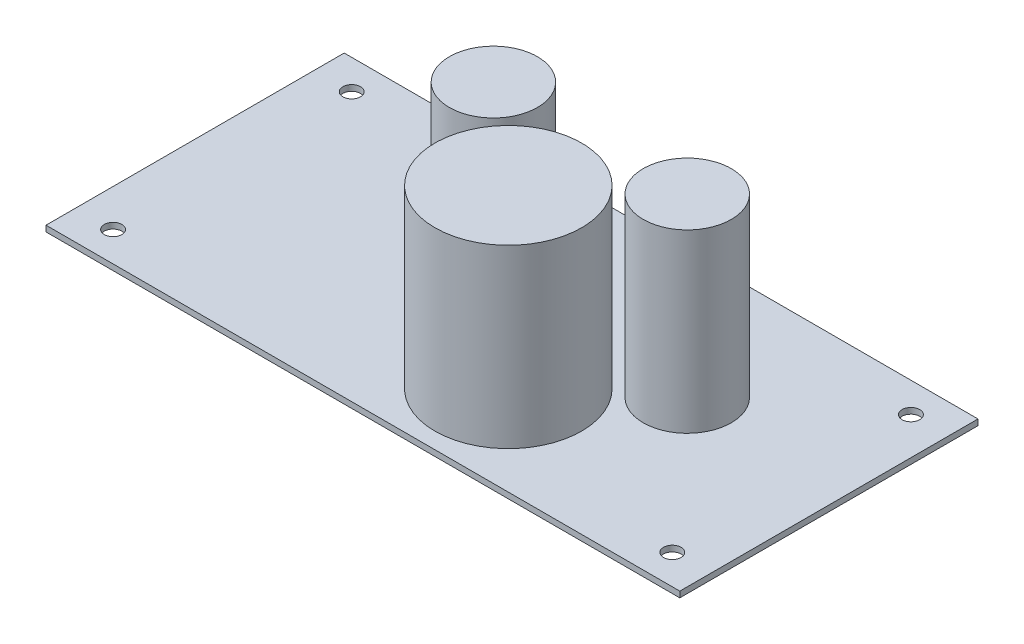
ISO-10303-21;
HEADER;
FILE_DESCRIPTION(('STEP AP214'),'2;1');
FILE_NAME('part.step','',(''),(''),'','','');
FILE_SCHEMA(('AUTOMOTIVE_DESIGN { 1 0 10303 214 1 1 1 1 }'));
ENDSEC;
DATA;
#1=APPLICATION_CONTEXT('core data for automotive mechanical design processes');
#2=APPLICATION_PROTOCOL_DEFINITION('international standard','automotive_design',2000,#1);
#3=PRODUCT_CONTEXT('',#1,'mechanical');
#4=PRODUCT('Part','Part','',(#3));
#5=PRODUCT_RELATED_PRODUCT_CATEGORY('part','',(#4));
#6=PRODUCT_DEFINITION_FORMATION('','',#4);
#7=PRODUCT_DEFINITION_CONTEXT('part definition',#1,'design');
#8=PRODUCT_DEFINITION('design','',#6,#7);
#9=PRODUCT_DEFINITION_SHAPE('','',#8);
#10=(LENGTH_UNIT() NAMED_UNIT(*) SI_UNIT(.MILLI.,.METRE.));
#11=(NAMED_UNIT(*) PLANE_ANGLE_UNIT() SI_UNIT($,.RADIAN.));
#12=(NAMED_UNIT(*) SI_UNIT($,.STERADIAN.) SOLID_ANGLE_UNIT());
#13=UNCERTAINTY_MEASURE_WITH_UNIT(LENGTH_MEASURE(1.E-05),#10,'distance_accuracy_value','');
#14=(GEOMETRIC_REPRESENTATION_CONTEXT(3) GLOBAL_UNCERTAINTY_ASSIGNED_CONTEXT((#13)) GLOBAL_UNIT_ASSIGNED_CONTEXT((#10,
#11,#12)) REPRESENTATION_CONTEXT('',''));
#15=CARTESIAN_POINT('',(0.,0.,0.));
#16=DIRECTION('',(0.,0.,1.));
#17=DIRECTION('',(1.,0.,0.));
#18=AXIS2_PLACEMENT_3D('',#15,#16,#17);
#19=CARTESIAN_POINT('',(-53.975,1.,-25.395));
#20=DIRECTION('',(1.,0.,0.));
#21=DIRECTION('',(0.,0.,-1.));
#22=AXIS2_PLACEMENT_3D('',#19,#20,#21);
#23=PLANE('',#22);
#24=DIRECTION('',(0.,0.,1.));
#25=VECTOR('',#24,1.);
#26=CARTESIAN_POINT('',(-53.975,0.,-25.395));
#27=LINE('',#26,#25);
#28=CARTESIAN_POINT('',(-53.975,0.,-25.395));
#29=VERTEX_POINT('',#28);
#30=CARTESIAN_POINT('',(-53.975,0.,25.395));
#31=VERTEX_POINT('',#30);
#32=EDGE_CURVE('E98',#29,#31,#27,.T.);
#33=ORIENTED_EDGE('',*,*,#32,.T.);
#34=DIRECTION('',(0.,-1.,0.));
#35=VECTOR('',#34,1.);
#36=CARTESIAN_POINT('',(-53.975,1.,25.395));
#37=LINE('',#36,#35);
#38=CARTESIAN_POINT('',(-53.975,1.,25.395));
#39=VERTEX_POINT('',#38);
#40=EDGE_CURVE('E11',#39,#31,#37,.T.);
#41=ORIENTED_EDGE('',*,*,#40,.F.);
#42=DIRECTION('',(0.,0.,1.));
#43=VECTOR('',#42,1.);
#44=CARTESIAN_POINT('',(-53.975,1.,-25.395));
#45=LINE('',#44,#43);
#46=CARTESIAN_POINT('',(-53.975,1.,-25.395));
#47=VERTEX_POINT('',#46);
#48=EDGE_CURVE('E86',#47,#39,#45,.T.);
#49=ORIENTED_EDGE('',*,*,#48,.F.);
#50=DIRECTION('',(0.,-1.,0.));
#51=VECTOR('',#50,1.);
#52=CARTESIAN_POINT('',(-53.975,1.,-25.395));
#53=LINE('',#52,#51);
#54=EDGE_CURVE('E94',#47,#29,#53,.T.);
#55=ORIENTED_EDGE('',*,*,#54,.T.);
#56=EDGE_LOOP('',(#33,#41,#49,#55));
#57=FACE_BOUND('',#56,.T.);
#58=ADVANCED_FACE('F35',(#57),#23,.F.);
#59=CARTESIAN_POINT('',(-53.975,1.,25.395));
#60=DIRECTION('',(0.,0.,-1.));
#61=DIRECTION('',(-1.,0.,0.));
#62=AXIS2_PLACEMENT_3D('',#59,#60,#61);
#63=PLANE('',#62);
#64=DIRECTION('',(1.,0.,0.));
#65=VECTOR('',#64,1.);
#66=CARTESIAN_POINT('',(-53.975,0.,25.395));
#67=LINE('',#66,#65);
#68=CARTESIAN_POINT('',(53.975,0.,25.395));
#69=VERTEX_POINT('',#68);
#70=EDGE_CURVE('E90',#31,#69,#67,.T.);
#71=ORIENTED_EDGE('',*,*,#70,.T.);
#72=DIRECTION('',(0.,-1.,0.));
#73=VECTOR('',#72,1.);
#74=CARTESIAN_POINT('',(53.975,1.,25.395));
#75=LINE('',#74,#73);
#76=CARTESIAN_POINT('',(53.975,1.,25.395));
#77=VERTEX_POINT('',#76);
#78=EDGE_CURVE('E43',#77,#69,#75,.T.);
#79=ORIENTED_EDGE('',*,*,#78,.F.);
#80=DIRECTION('',(1.,0.,0.));
#81=VECTOR('',#80,1.);
#82=CARTESIAN_POINT('',(-53.975,1.,25.395));
#83=LINE('',#82,#81);
#84=EDGE_CURVE('E81',#39,#77,#83,.T.);
#85=ORIENTED_EDGE('',*,*,#84,.F.);
#86=ORIENTED_EDGE('',*,*,#40,.T.);
#87=EDGE_LOOP('',(#71,#79,#85,#86));
#88=FACE_BOUND('',#87,.T.);
#89=ADVANCED_FACE('F89',(#88),#63,.F.);
#90=CARTESIAN_POINT('',(53.975,1.,-25.395));
#91=DIRECTION('',(-1.,0.,0.));
#92=DIRECTION('',(0.,0.,1.));
#93=AXIS2_PLACEMENT_3D('',#90,#91,#92);
#94=PLANE('',#93);
#95=DIRECTION('',(0.,0.,-1.));
#96=VECTOR('',#95,1.);
#97=CARTESIAN_POINT('',(53.975,0.,-25.395));
#98=LINE('',#97,#96);
#99=CARTESIAN_POINT('',(53.975,0.,-25.395));
#100=VERTEX_POINT('',#99);
#101=EDGE_CURVE('E68',#69,#100,#98,.T.);
#102=ORIENTED_EDGE('',*,*,#101,.T.);
#103=DIRECTION('',(0.,-1.,0.));
#104=VECTOR('',#103,1.);
#105=CARTESIAN_POINT('',(53.975,1.,-25.395));
#106=LINE('',#105,#104);
#107=CARTESIAN_POINT('',(53.975,1.,-25.395));
#108=VERTEX_POINT('',#107);
#109=EDGE_CURVE('E91',#108,#100,#106,.T.);
#110=ORIENTED_EDGE('',*,*,#109,.F.);
#111=DIRECTION('',(0.,0.,-1.));
#112=VECTOR('',#111,1.);
#113=CARTESIAN_POINT('',(53.975,1.,-25.395));
#114=LINE('',#113,#112);
#115=EDGE_CURVE('E84',#77,#108,#114,.T.);
#116=ORIENTED_EDGE('',*,*,#115,.F.);
#117=ORIENTED_EDGE('',*,*,#78,.T.);
#118=EDGE_LOOP('',(#102,#110,#116,#117));
#119=FACE_BOUND('',#118,.T.);
#120=ADVANCED_FACE('F92',(#119),#94,.F.);
#121=CARTESIAN_POINT('',(-53.975,1.,-25.395));
#122=DIRECTION('',(0.,0.,1.));
#123=DIRECTION('',(1.,0.,0.));
#124=AXIS2_PLACEMENT_3D('',#121,#122,#123);
#125=PLANE('',#124);
#126=DIRECTION('',(-1.,0.,0.));
#127=VECTOR('',#126,1.);
#128=CARTESIAN_POINT('',(-53.975,0.,-25.395));
#129=LINE('',#128,#127);
#130=EDGE_CURVE('E74',#100,#29,#129,.T.);
#131=ORIENTED_EDGE('',*,*,#130,.T.);
#132=ORIENTED_EDGE('',*,*,#54,.F.);
#133=DIRECTION('',(-1.,0.,0.));
#134=VECTOR('',#133,1.);
#135=CARTESIAN_POINT('',(-53.975,1.,-25.395));
#136=LINE('',#135,#134);
#137=EDGE_CURVE('E51',#108,#47,#136,.T.);
#138=ORIENTED_EDGE('',*,*,#137,.F.);
#139=ORIENTED_EDGE('',*,*,#109,.T.);
#140=EDGE_LOOP('',(#131,#132,#138,#139));
#141=FACE_BOUND('',#140,.T.);
#142=ADVANCED_FACE('F106',(#141),#125,.F.);
#143=CARTESIAN_POINT('',(0.,1.,0.));
#144=DIRECTION('',(0.,1.,0.));
#145=DIRECTION('',(0.,0.,1.));
#146=AXIS2_PLACEMENT_3D('',#143,#144,#145);
#147=PLANE('',#146);
#148=CARTESIAN_POINT('',(9.52499999999999,1.,10.155));
#149=DIRECTION('',(0.,1.,0.));
#150=DIRECTION('',(0.,0.,1.));
#151=AXIS2_PLACEMENT_3D('',#148,#149,#150);
#152=CIRCLE('',#151,12.5);
#153=CARTESIAN_POINT('',(9.52499999999999,1.,22.655));
#154=VERTEX_POINT('',#153);
#155=EDGE_CURVE('E148',#154,#154,#152,.T.);
#156=ORIENTED_EDGE('',*,*,#155,.F.);
#157=EDGE_LOOP('',(#156));
#158=FACE_BOUND('',#157,.T.);
#159=CARTESIAN_POINT('',(-6.98500000000001,1.,-3.815));
#160=DIRECTION('',(0.,1.,0.));
#161=DIRECTION('',(0.,0.,1.));
#162=AXIS2_PLACEMENT_3D('',#159,#160,#161);
#163=CIRCLE('',#162,7.5);
#164=CARTESIAN_POINT('',(-6.98500000000001,1.,3.685));
#165=VERTEX_POINT('',#164);
#166=EDGE_CURVE('E142',#165,#165,#163,.T.);
#167=ORIENTED_EDGE('',*,*,#166,.F.);
#168=EDGE_LOOP('',(#167));
#169=FACE_BOUND('',#168,.T.);
#170=CARTESIAN_POINT('',(26.035,1.,-3.815));
#171=DIRECTION('',(0.,1.,0.));
#172=DIRECTION('',(0.,0.,1.));
#173=AXIS2_PLACEMENT_3D('',#170,#171,#172);
#174=CIRCLE('',#173,7.5);
#175=CARTESIAN_POINT('',(26.035,1.,3.685));
#176=VERTEX_POINT('',#175);
#177=EDGE_CURVE('E136',#176,#176,#174,.T.);
#178=ORIENTED_EDGE('',*,*,#177,.F.);
#179=EDGE_LOOP('',(#178));
#180=FACE_BOUND('',#179,.T.);
#181=CARTESIAN_POINT('',(-47.625,1.,20.32));
#182=DIRECTION('',(0.,1.,0.));
#183=DIRECTION('',(0.,0.,1.));
#184=AXIS2_PLACEMENT_3D('',#181,#182,#183);
#185=CIRCLE('',#184,1.5);
#186=CARTESIAN_POINT('',(-47.625,1.,21.82));
#187=VERTEX_POINT('',#186);
#188=EDGE_CURVE('E130',#187,#187,#185,.T.);
#189=ORIENTED_EDGE('',*,*,#188,.F.);
#190=EDGE_LOOP('',(#189));
#191=FACE_BOUND('',#190,.T.);
#192=CARTESIAN_POINT('',(47.625,1.,20.32));
#193=DIRECTION('',(0.,1.,0.));
#194=DIRECTION('',(0.,0.,1.));
#195=AXIS2_PLACEMENT_3D('',#192,#193,#194);
#196=CIRCLE('',#195,1.5);
#197=CARTESIAN_POINT('',(47.625,1.,21.82));
#198=VERTEX_POINT('',#197);
#199=EDGE_CURVE('E124',#198,#198,#196,.T.);
#200=ORIENTED_EDGE('',*,*,#199,.F.);
#201=EDGE_LOOP('',(#200));
#202=FACE_BOUND('',#201,.T.);
#203=CARTESIAN_POINT('',(47.625,1.,-20.32));
#204=DIRECTION('',(0.,1.,0.));
#205=DIRECTION('',(0.,0.,1.));
#206=AXIS2_PLACEMENT_3D('',#203,#204,#205);
#207=CIRCLE('',#206,1.5);
#208=CARTESIAN_POINT('',(47.625,1.,-18.82));
#209=VERTEX_POINT('',#208);
#210=EDGE_CURVE('E118',#209,#209,#207,.T.);
#211=ORIENTED_EDGE('',*,*,#210,.F.);
#212=EDGE_LOOP('',(#211));
#213=FACE_BOUND('',#212,.T.);
#214=CARTESIAN_POINT('',(-47.625,1.,-20.32));
#215=DIRECTION('',(0.,1.,0.));
#216=DIRECTION('',(0.,0.,1.));
#217=AXIS2_PLACEMENT_3D('',#214,#215,#216);
#218=CIRCLE('',#217,1.5);
#219=CARTESIAN_POINT('',(-47.625,1.,-18.82));
#220=VERTEX_POINT('',#219);
#221=EDGE_CURVE('E112',#220,#220,#218,.T.);
#222=ORIENTED_EDGE('',*,*,#221,.F.);
#223=EDGE_LOOP('',(#222));
#224=FACE_BOUND('',#223,.T.);
#225=ORIENTED_EDGE('',*,*,#48,.T.);
#226=ORIENTED_EDGE('',*,*,#84,.T.);
#227=ORIENTED_EDGE('',*,*,#115,.T.);
#228=ORIENTED_EDGE('',*,*,#137,.T.);
#229=EDGE_LOOP('',(#225,#226,#227,#228));
#230=FACE_BOUND('',#229,.T.);
#231=ADVANCED_FACE('F82',(#158,#169,#180,#191,#202,#213,#224,#230),#147,.T.);
#232=CARTESIAN_POINT('',(0.,0.,0.));
#233=DIRECTION('',(0.,1.,0.));
#234=DIRECTION('',(0.,0.,1.));
#235=AXIS2_PLACEMENT_3D('',#232,#233,#234);
#236=PLANE('',#235);
#237=CARTESIAN_POINT('',(-47.625,0.,20.32));
#238=DIRECTION('',(0.,1.,0.));
#239=DIRECTION('',(0.,0.,1.));
#240=AXIS2_PLACEMENT_3D('',#237,#238,#239);
#241=CIRCLE('',#240,1.5);
#242=CARTESIAN_POINT('',(-47.625,0.,21.82));
#243=VERTEX_POINT('',#242);
#244=EDGE_CURVE('E127',#243,#243,#241,.T.);
#245=ORIENTED_EDGE('',*,*,#244,.T.);
#246=EDGE_LOOP('',(#245));
#247=FACE_BOUND('',#246,.T.);
#248=CARTESIAN_POINT('',(47.625,0.,20.32));
#249=DIRECTION('',(0.,1.,0.));
#250=DIRECTION('',(0.,0.,1.));
#251=AXIS2_PLACEMENT_3D('',#248,#249,#250);
#252=CIRCLE('',#251,1.5);
#253=CARTESIAN_POINT('',(47.625,0.,21.82));
#254=VERTEX_POINT('',#253);
#255=EDGE_CURVE('E121',#254,#254,#252,.T.);
#256=ORIENTED_EDGE('',*,*,#255,.T.);
#257=EDGE_LOOP('',(#256));
#258=FACE_BOUND('',#257,.T.);
#259=CARTESIAN_POINT('',(47.625,0.,-20.32));
#260=DIRECTION('',(0.,1.,0.));
#261=DIRECTION('',(0.,0.,1.));
#262=AXIS2_PLACEMENT_3D('',#259,#260,#261);
#263=CIRCLE('',#262,1.5);
#264=CARTESIAN_POINT('',(47.625,0.,-18.82));
#265=VERTEX_POINT('',#264);
#266=EDGE_CURVE('E115',#265,#265,#263,.T.);
#267=ORIENTED_EDGE('',*,*,#266,.T.);
#268=EDGE_LOOP('',(#267));
#269=FACE_BOUND('',#268,.T.);
#270=CARTESIAN_POINT('',(-47.625,0.,-20.32));
#271=DIRECTION('',(0.,1.,0.));
#272=DIRECTION('',(0.,0.,1.));
#273=AXIS2_PLACEMENT_3D('',#270,#271,#272);
#274=CIRCLE('',#273,1.5);
#275=CARTESIAN_POINT('',(-47.625,0.,-18.82));
#276=VERTEX_POINT('',#275);
#277=EDGE_CURVE('E101',#276,#276,#274,.T.);
#278=ORIENTED_EDGE('',*,*,#277,.T.);
#279=EDGE_LOOP('',(#278));
#280=FACE_BOUND('',#279,.T.);
#281=ORIENTED_EDGE('',*,*,#32,.F.);
#282=ORIENTED_EDGE('',*,*,#130,.F.);
#283=ORIENTED_EDGE('',*,*,#101,.F.);
#284=ORIENTED_EDGE('',*,*,#70,.F.);
#285=EDGE_LOOP('',(#281,#282,#283,#284));
#286=FACE_BOUND('',#285,.T.);
#287=ADVANCED_FACE('F109',(#247,#258,#269,#280,#286),#236,.F.);
#288=CARTESIAN_POINT('',(-47.625,0.,-20.32));
#289=DIRECTION('',(0.,1.,0.));
#290=DIRECTION('',(0.,0.,1.));
#291=AXIS2_PLACEMENT_3D('',#288,#289,#290);
#292=CYLINDRICAL_SURFACE('',#291,1.5);
#293=ORIENTED_EDGE('',*,*,#277,.F.);
#294=EDGE_LOOP('',(#293));
#295=FACE_BOUND('',#294,.T.);
#296=ORIENTED_EDGE('',*,*,#221,.T.);
#297=EDGE_LOOP('',(#296));
#298=FACE_BOUND('',#297,.T.);
#299=ADVANCED_FACE('F178',(#295,#298),#292,.F.);
#300=CARTESIAN_POINT('',(47.625,0.,-20.32));
#301=DIRECTION('',(0.,1.,0.));
#302=DIRECTION('',(0.,0.,1.));
#303=AXIS2_PLACEMENT_3D('',#300,#301,#302);
#304=CYLINDRICAL_SURFACE('',#303,1.5);
#305=ORIENTED_EDGE('',*,*,#266,.F.);
#306=EDGE_LOOP('',(#305));
#307=FACE_BOUND('',#306,.T.);
#308=ORIENTED_EDGE('',*,*,#210,.T.);
#309=EDGE_LOOP('',(#308));
#310=FACE_BOUND('',#309,.T.);
#311=ADVANCED_FACE('F180',(#307,#310),#304,.F.);
#312=CARTESIAN_POINT('',(47.625,0.,20.32));
#313=DIRECTION('',(0.,1.,0.));
#314=DIRECTION('',(0.,0.,1.));
#315=AXIS2_PLACEMENT_3D('',#312,#313,#314);
#316=CYLINDRICAL_SURFACE('',#315,1.5);
#317=ORIENTED_EDGE('',*,*,#255,.F.);
#318=EDGE_LOOP('',(#317));
#319=FACE_BOUND('',#318,.T.);
#320=ORIENTED_EDGE('',*,*,#199,.T.);
#321=EDGE_LOOP('',(#320));
#322=FACE_BOUND('',#321,.T.);
#323=ADVANCED_FACE('F187',(#319,#322),#316,.F.);
#324=CARTESIAN_POINT('',(-47.625,0.,20.32));
#325=DIRECTION('',(0.,1.,0.));
#326=DIRECTION('',(0.,0.,1.));
#327=AXIS2_PLACEMENT_3D('',#324,#325,#326);
#328=CYLINDRICAL_SURFACE('',#327,1.5);
#329=ORIENTED_EDGE('',*,*,#244,.F.);
#330=EDGE_LOOP('',(#329));
#331=FACE_BOUND('',#330,.T.);
#332=ORIENTED_EDGE('',*,*,#188,.T.);
#333=EDGE_LOOP('',(#332));
#334=FACE_BOUND('',#333,.T.);
#335=ADVANCED_FACE('F235',(#331,#334),#328,.F.);
#336=CARTESIAN_POINT('',(26.035,31.,-3.815));
#337=DIRECTION('',(0.,-1.,0.));
#338=DIRECTION('',(0.,0.,-1.));
#339=AXIS2_PLACEMENT_3D('',#336,#337,#338);
#340=CYLINDRICAL_SURFACE('',#339,7.5);
#341=CARTESIAN_POINT('',(26.035,31.,-3.815));
#342=DIRECTION('',(0.,1.,0.));
#343=DIRECTION('',(0.,0.,1.));
#344=AXIS2_PLACEMENT_3D('',#341,#342,#343);
#345=CIRCLE('',#344,7.5);
#346=CARTESIAN_POINT('',(26.035,31.,3.685));
#347=VERTEX_POINT('',#346);
#348=EDGE_CURVE('E133',#347,#347,#345,.T.);
#349=ORIENTED_EDGE('',*,*,#348,.F.);
#350=EDGE_LOOP('',(#349));
#351=FACE_BOUND('',#350,.T.);
#352=ORIENTED_EDGE('',*,*,#177,.T.);
#353=EDGE_LOOP('',(#352));
#354=FACE_BOUND('',#353,.T.);
#355=ADVANCED_FACE('F244',(#351,#354),#340,.T.);
#356=CARTESIAN_POINT('',(26.035,31.,-3.815));
#357=DIRECTION('',(0.,1.,0.));
#358=DIRECTION('',(0.,0.,1.));
#359=AXIS2_PLACEMENT_3D('',#356,#357,#358);
#360=PLANE('',#359);
#361=ORIENTED_EDGE('',*,*,#348,.T.);
#362=EDGE_LOOP('',(#361));
#363=FACE_BOUND('',#362,.T.);
#364=ADVANCED_FACE('F255',(#363),#360,.T.);
#365=CARTESIAN_POINT('',(-6.98500000000001,31.,-3.815));
#366=DIRECTION('',(0.,-1.,0.));
#367=DIRECTION('',(0.,0.,-1.));
#368=AXIS2_PLACEMENT_3D('',#365,#366,#367);
#369=CYLINDRICAL_SURFACE('',#368,7.5);
#370=CARTESIAN_POINT('',(-6.98500000000001,31.,-3.815));
#371=DIRECTION('',(0.,1.,0.));
#372=DIRECTION('',(0.,0.,1.));
#373=AXIS2_PLACEMENT_3D('',#370,#371,#372);
#374=CIRCLE('',#373,7.5);
#375=CARTESIAN_POINT('',(-6.98500000000001,31.,3.685));
#376=VERTEX_POINT('',#375);
#377=EDGE_CURVE('E139',#376,#376,#374,.T.);
#378=ORIENTED_EDGE('',*,*,#377,.F.);
#379=EDGE_LOOP('',(#378));
#380=FACE_BOUND('',#379,.T.);
#381=ORIENTED_EDGE('',*,*,#166,.T.);
#382=EDGE_LOOP('',(#381));
#383=FACE_BOUND('',#382,.T.);
#384=ADVANCED_FACE('F264',(#380,#383),#369,.T.);
#385=CARTESIAN_POINT('',(-6.98500000000001,31.,-3.815));
#386=DIRECTION('',(0.,1.,0.));
#387=DIRECTION('',(0.,0.,1.));
#388=AXIS2_PLACEMENT_3D('',#385,#386,#387);
#389=PLANE('',#388);
#390=ORIENTED_EDGE('',*,*,#377,.T.);
#391=EDGE_LOOP('',(#390));
#392=FACE_BOUND('',#391,.T.);
#393=ADVANCED_FACE('F159',(#392),#389,.T.);
#394=CARTESIAN_POINT('',(9.52499999999999,31.,10.155));
#395=DIRECTION('',(0.,-1.,0.));
#396=DIRECTION('',(0.,0.,-1.));
#397=AXIS2_PLACEMENT_3D('',#394,#395,#396);
#398=CYLINDRICAL_SURFACE('',#397,12.5);
#399=CARTESIAN_POINT('',(9.52499999999999,31.,10.155));
#400=DIRECTION('',(0.,1.,0.));
#401=DIRECTION('',(0.,0.,1.));
#402=AXIS2_PLACEMENT_3D('',#399,#400,#401);
#403=CIRCLE('',#402,12.5);
#404=CARTESIAN_POINT('',(9.52499999999999,31.,22.655));
#405=VERTEX_POINT('',#404);
#406=EDGE_CURVE('E145',#405,#405,#403,.T.);
#407=ORIENTED_EDGE('',*,*,#406,.F.);
#408=EDGE_LOOP('',(#407));
#409=FACE_BOUND('',#408,.T.);
#410=ORIENTED_EDGE('',*,*,#155,.T.);
#411=EDGE_LOOP('',(#410));
#412=FACE_BOUND('',#411,.T.);
#413=ADVANCED_FACE('F156',(#409,#412),#398,.T.);
#414=CARTESIAN_POINT('',(9.52499999999999,31.,10.155));
#415=DIRECTION('',(0.,1.,0.));
#416=DIRECTION('',(0.,0.,1.));
#417=AXIS2_PLACEMENT_3D('',#414,#415,#416);
#418=PLANE('',#417);
#419=ORIENTED_EDGE('',*,*,#406,.T.);
#420=EDGE_LOOP('',(#419));
#421=FACE_BOUND('',#420,.T.);
#422=ADVANCED_FACE('F154',(#421),#418,.T.);
#423=CLOSED_SHELL('',(#58,#89,#120,#142,#231,#287,#299,#311,#323,#335,#355,#364,#384,#393,#413,#422));
#424=MANIFOLD_SOLID_BREP('B2',#423);
#425=ADVANCED_BREP_SHAPE_REPRESENTATION('',(#18,#424),#14);
#426=SHAPE_DEFINITION_REPRESENTATION(#9,#425);
ENDSEC;
END-ISO-10303-21;
